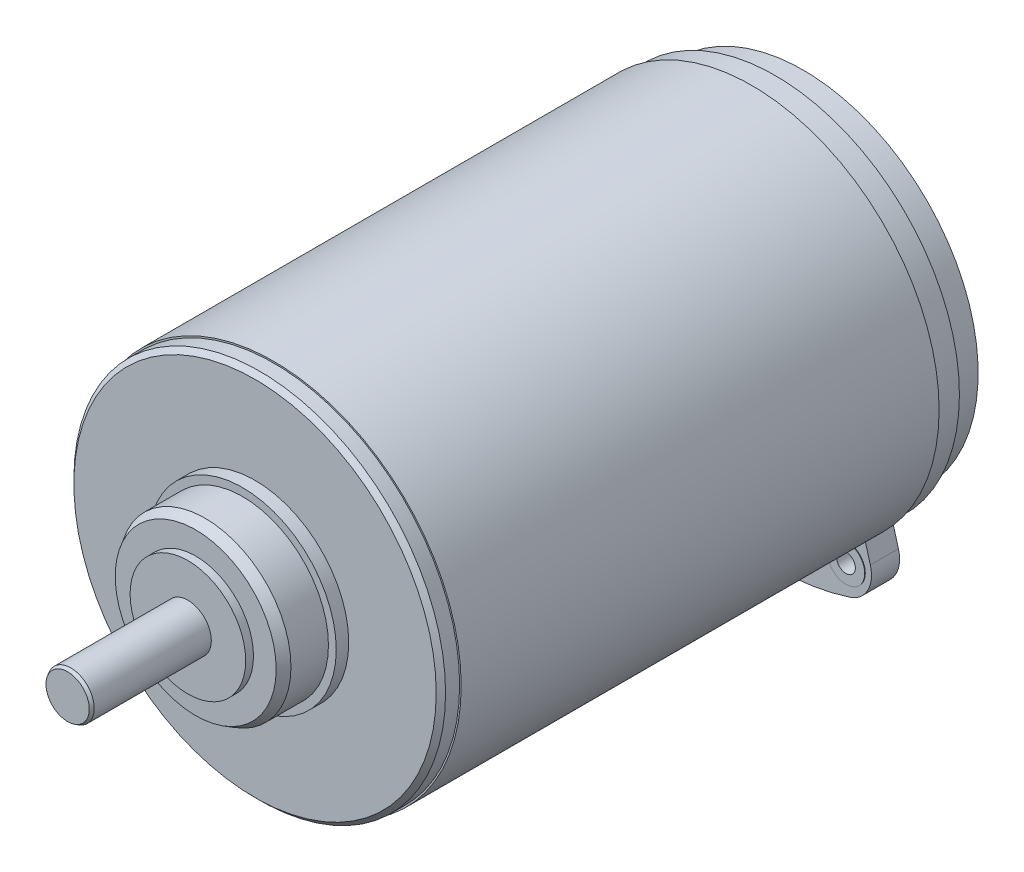
ISO-10303-21;
HEADER;
FILE_DESCRIPTION(('STEP AP214'),'2;1');
FILE_NAME('part.step','',(''),(''),'','','');
FILE_SCHEMA(('AUTOMOTIVE_DESIGN { 1 0 10303 214 1 1 1 1 }'));
ENDSEC;
DATA;
#1=APPLICATION_CONTEXT('core data for automotive mechanical design processes');
#2=APPLICATION_PROTOCOL_DEFINITION('international standard','automotive_design',2000,#1);
#3=PRODUCT_CONTEXT('',#1,'mechanical');
#4=PRODUCT('Part','Part','',(#3));
#5=PRODUCT_RELATED_PRODUCT_CATEGORY('part','',(#4));
#6=PRODUCT_DEFINITION_FORMATION('','',#4);
#7=PRODUCT_DEFINITION_CONTEXT('part definition',#1,'design');
#8=PRODUCT_DEFINITION('design','',#6,#7);
#9=PRODUCT_DEFINITION_SHAPE('','',#8);
#10=(LENGTH_UNIT() NAMED_UNIT(*) SI_UNIT(.MILLI.,.METRE.));
#11=(NAMED_UNIT(*) PLANE_ANGLE_UNIT() SI_UNIT($,.RADIAN.));
#12=(NAMED_UNIT(*) SI_UNIT($,.STERADIAN.) SOLID_ANGLE_UNIT());
#13=UNCERTAINTY_MEASURE_WITH_UNIT(LENGTH_MEASURE(1.E-05),#10,'distance_accuracy_value','');
#14=(GEOMETRIC_REPRESENTATION_CONTEXT(3) GLOBAL_UNCERTAINTY_ASSIGNED_CONTEXT((#13)) GLOBAL_UNIT_ASSIGNED_CONTEXT((#10,
#11,#12)) REPRESENTATION_CONTEXT('',''));
#15=CARTESIAN_POINT('',(0.,0.,0.));
#16=DIRECTION('',(0.,0.,1.));
#17=DIRECTION('',(1.,0.,0.));
#18=AXIS2_PLACEMENT_3D('',#15,#16,#17);
#19=CARTESIAN_POINT('',(-0.775442014310161,-6.80596721138463,-16.632));
#20=DIRECTION('',(0.,0.,-1.));
#21=DIRECTION('',(0.,-1.,0.));
#22=AXIS2_PLACEMENT_3D('',#19,#20,#21);
#23=PLANE('',#22);
#24=CARTESIAN_POINT('',(-0.775442014310161,-6.80596721138463,-16.632));
#25=DIRECTION('',(0.,0.,1.));
#26=DIRECTION('',(1.,0.,0.));
#27=AXIS2_PLACEMENT_3D('',#24,#25,#26);
#28=CIRCLE('',#27,0.6);
#29=CARTESIAN_POINT('',(-0.175442014310161,-6.80596721138463,-16.632));
#30=VERTEX_POINT('',#29);
#31=EDGE_CURVE('E11',#30,#30,#28,.T.);
#32=ORIENTED_EDGE('',*,*,#31,.T.);
#33=EDGE_LOOP('',(#32));
#34=FACE_BOUND('',#33,.T.);
#35=CARTESIAN_POINT('',(-0.775442014310161,-6.80596721138463,-16.632));
#36=DIRECTION('',(0.,0.,1.));
#37=DIRECTION('',(1.,0.,0.));
#38=AXIS2_PLACEMENT_3D('',#35,#36,#37);
#39=CIRCLE('',#38,0.3);
#40=CARTESIAN_POINT('',(-0.475442014310161,-6.80596721138463,-16.632));
#41=VERTEX_POINT('',#40);
#42=EDGE_CURVE('E324',#41,#41,#39,.T.);
#43=ORIENTED_EDGE('',*,*,#42,.F.);
#44=EDGE_LOOP('',(#43));
#45=FACE_BOUND('',#44,.T.);
#46=ADVANCED_FACE('F16',(#34,#45),#23,.F.);
#47=CARTESIAN_POINT('',(-0.775442014310161,-6.80596721138463,-17.568));
#48=DIRECTION('',(0.,0.,-1.));
#49=DIRECTION('',(0.,-1.,0.));
#50=AXIS2_PLACEMENT_3D('',#47,#48,#49);
#51=PLANE('',#50);
#52=CARTESIAN_POINT('',(-0.775442014310161,-6.80596721138463,-17.568));
#53=DIRECTION('',(0.,0.,1.));
#54=DIRECTION('',(1.,0.,0.));
#55=AXIS2_PLACEMENT_3D('',#52,#53,#54);
#56=CIRCLE('',#55,0.6);
#57=CARTESIAN_POINT('',(-0.175442014310161,-6.80596721138463,-17.568));
#58=VERTEX_POINT('',#57);
#59=EDGE_CURVE('E280',#58,#58,#56,.T.);
#60=ORIENTED_EDGE('',*,*,#59,.F.);
#61=EDGE_LOOP('',(#60));
#62=FACE_BOUND('',#61,.T.);
#63=CARTESIAN_POINT('',(-0.775442014310161,-6.80596721138463,-17.568));
#64=DIRECTION('',(0.,0.,1.));
#65=DIRECTION('',(1.,0.,0.));
#66=AXIS2_PLACEMENT_3D('',#63,#64,#65);
#67=CIRCLE('',#66,0.3);
#68=CARTESIAN_POINT('',(-0.475442014310161,-6.80596721138463,-17.568));
#69=VERTEX_POINT('',#68);
#70=EDGE_CURVE('E27',#69,#69,#67,.T.);
#71=ORIENTED_EDGE('',*,*,#70,.T.);
#72=EDGE_LOOP('',(#71));
#73=FACE_BOUND('',#72,.T.);
#74=ADVANCED_FACE('F18',(#62,#73),#51,.T.);
#75=CARTESIAN_POINT('',(-2.28657698575133,-6.45709421398143,-16.632));
#76=DIRECTION('',(0.,0.,-1.));
#77=DIRECTION('',(0.,-1.,0.));
#78=AXIS2_PLACEMENT_3D('',#75,#76,#77);
#79=PLANE('',#78);
#80=CARTESIAN_POINT('',(-2.28657698575133,-6.45709421398143,-16.632));
#81=DIRECTION('',(0.,0.,1.));
#82=DIRECTION('',(0.974370064785235,-0.224951054343866,0.));
#83=AXIS2_PLACEMENT_3D('',#80,#81,#82);
#84=CIRCLE('',#83,0.6);
#85=CARTESIAN_POINT('',(-1.70195494688019,-6.59206484658775,-16.632));
#86=VERTEX_POINT('',#85);
#87=EDGE_CURVE('E306',#86,#86,#84,.T.);
#88=ORIENTED_EDGE('',*,*,#87,.T.);
#89=EDGE_LOOP('',(#88));
#90=FACE_BOUND('',#89,.T.);
#91=CARTESIAN_POINT('',(-2.28657698575133,-6.45709421398143,-16.632));
#92=DIRECTION('',(0.,0.,1.));
#93=DIRECTION('',(0.974370064785235,-0.224951054343866,0.));
#94=AXIS2_PLACEMENT_3D('',#91,#92,#93);
#95=CIRCLE('',#94,0.3);
#96=CARTESIAN_POINT('',(-1.99426596631576,-6.52457953028459,-16.632));
#97=VERTEX_POINT('',#96);
#98=EDGE_CURVE('E319',#97,#97,#95,.T.);
#99=ORIENTED_EDGE('',*,*,#98,.F.);
#100=EDGE_LOOP('',(#99));
#101=FACE_BOUND('',#100,.T.);
#102=ADVANCED_FACE('F498',(#90,#101),#79,.F.);
#103=CARTESIAN_POINT('',(-2.28657698575133,-6.45709421398143,-17.568));
#104=DIRECTION('',(0.,0.,-1.));
#105=DIRECTION('',(0.,-1.,0.));
#106=AXIS2_PLACEMENT_3D('',#103,#104,#105);
#107=PLANE('',#106);
#108=CARTESIAN_POINT('',(-2.28657698575133,-6.45709421398143,-17.568));
#109=DIRECTION('',(0.,0.,1.));
#110=DIRECTION('',(0.974370064785235,-0.224951054343866,0.));
#111=AXIS2_PLACEMENT_3D('',#108,#109,#110);
#112=CIRCLE('',#111,0.6);
#113=CARTESIAN_POINT('',(-1.70195494688019,-6.59206484658775,-17.568));
#114=VERTEX_POINT('',#113);
#115=EDGE_CURVE('E275',#114,#114,#112,.T.);
#116=ORIENTED_EDGE('',*,*,#115,.F.);
#117=EDGE_LOOP('',(#116));
#118=FACE_BOUND('',#117,.T.);
#119=CARTESIAN_POINT('',(-2.28657698575133,-6.45709421398143,-17.568));
#120=DIRECTION('',(0.,0.,1.));
#121=DIRECTION('',(0.974370064785235,-0.224951054343866,0.));
#122=AXIS2_PLACEMENT_3D('',#119,#120,#121);
#123=CIRCLE('',#122,0.3);
#124=CARTESIAN_POINT('',(-1.99426596631576,-6.52457953028459,-17.568));
#125=VERTEX_POINT('',#124);
#126=EDGE_CURVE('E378',#125,#125,#123,.T.);
#127=ORIENTED_EDGE('',*,*,#126,.T.);
#128=EDGE_LOOP('',(#127));
#129=FACE_BOUND('',#128,.T.);
#130=ADVANCED_FACE('F604',(#118,#129),#107,.T.);
#131=CARTESIAN_POINT('',(0.,0.,-17.55));
#132=DIRECTION('',(0.,0.,-1.));
#133=DIRECTION('',(0.,-1.,0.));
#134=AXIS2_PLACEMENT_3D('',#131,#132,#133);
#135=PLANE('',#134);
#136=CARTESIAN_POINT('',(-2.28657698575133,-6.45709421398143,-17.55));
#137=DIRECTION('',(0.,0.,1.));
#138=DIRECTION('',(-1.,0.,0.));
#139=AXIS2_PLACEMENT_3D('',#136,#137,#138);
#140=CIRCLE('',#139,0.6);
#141=CARTESIAN_POINT('',(-2.88657698575133,-6.45709421398143,-17.55));
#142=VERTEX_POINT('',#141);
#143=EDGE_CURVE('E400',#142,#142,#140,.T.);
#144=ORIENTED_EDGE('',*,*,#143,.T.);
#145=EDGE_LOOP('',(#144));
#146=FACE_BOUND('',#145,.T.);
#147=CARTESIAN_POINT('',(2.28657698575133,-6.45709421398143,-17.55));
#148=DIRECTION('',(0.,0.,1.));
#149=DIRECTION('',(-1.,0.,0.));
#150=AXIS2_PLACEMENT_3D('',#147,#148,#149);
#151=CIRCLE('',#150,0.6);
#152=CARTESIAN_POINT('',(1.68657698575133,-6.45709421398143,-17.55));
#153=VERTEX_POINT('',#152);
#154=EDGE_CURVE('E404',#153,#153,#151,.T.);
#155=ORIENTED_EDGE('',*,*,#154,.T.);
#156=EDGE_LOOP('',(#155));
#157=FACE_BOUND('',#156,.T.);
#158=CARTESIAN_POINT('',(0.,0.,-17.55));
#159=DIRECTION('',(0.,0.,-1.));
#160=DIRECTION('',(-1.,0.,0.));
#161=AXIS2_PLACEMENT_3D('',#158,#159,#160);
#162=CIRCLE('',#161,5.6);
#163=CARTESIAN_POINT('',(-2.69825791088499,-4.90707695541313,-17.55));
#164=VERTEX_POINT('',#163);
#165=CARTESIAN_POINT('',(2.69825791088499,-4.90707695541313,-17.55));
#166=VERTEX_POINT('',#165);
#167=EDGE_CURVE('E448',#164,#166,#162,.T.);
#168=ORIENTED_EDGE('',*,*,#167,.T.);
#169=DIRECTION('',(-0.270785264534964,0.962639777128875,0.));
#170=VECTOR('',#169,1.);
#171=CARTESIAN_POINT('',(3.04763977712888,-6.14912711804472,-17.55));
#172=LINE('',#171,#170);
#173=CARTESIAN_POINT('',(3.04763977712888,-6.14912711804473,-17.55));
#174=VERTEX_POINT('',#173);
#175=EDGE_CURVE('E289',#174,#166,#172,.T.);
#176=ORIENTED_EDGE('',*,*,#175,.F.);
#177=CARTESIAN_POINT('',(2.085,-6.41991238257969,-17.55));
#178=DIRECTION('',(0.,0.,1.));
#179=DIRECTION('',(1.,0.,0.));
#180=AXIS2_PLACEMENT_3D('',#177,#178,#179);
#181=CIRCLE('',#180,1.);
#182=CARTESIAN_POINT('',(2.39388888888889,-7.37101051333223,-17.55));
#183=VERTEX_POINT('',#182);
#184=EDGE_CURVE('E465',#183,#174,#181,.T.);
#185=ORIENTED_EDGE('',*,*,#184,.F.);
#186=CARTESIAN_POINT('',(0.,0.,-17.55));
#187=DIRECTION('',(0.,0.,1.));
#188=DIRECTION('',(-1.,0.,0.));
#189=AXIS2_PLACEMENT_3D('',#186,#187,#188);
#190=CIRCLE('',#189,7.75);
#191=CARTESIAN_POINT('',(-2.39388888888889,-7.37101051333223,-17.55));
#192=VERTEX_POINT('',#191);
#193=EDGE_CURVE('E456',#192,#183,#190,.T.);
#194=ORIENTED_EDGE('',*,*,#193,.F.);
#195=CARTESIAN_POINT('',(-2.085,-6.41991238257969,-17.55));
#196=DIRECTION('',(0.,0.,1.));
#197=DIRECTION('',(1.,0.,0.));
#198=AXIS2_PLACEMENT_3D('',#195,#196,#197);
#199=CIRCLE('',#198,1.);
#200=CARTESIAN_POINT('',(-3.04763977712888,-6.14912711804473,-17.55));
#201=VERTEX_POINT('',#200);
#202=EDGE_CURVE('E273',#201,#192,#199,.T.);
#203=ORIENTED_EDGE('',*,*,#202,.F.);
#204=DIRECTION('',(-0.270785264534963,-0.962639777128875,0.));
#205=VECTOR('',#204,1.);
#206=CARTESIAN_POINT('',(-2.55888032509132,-4.41159058411596,-17.55));
#207=LINE('',#206,#205);
#208=EDGE_CURVE('E334',#164,#201,#207,.T.);
#209=ORIENTED_EDGE('',*,*,#208,.F.);
#210=EDGE_LOOP('',(#168,#176,#185,#194,#203,#209));
#211=FACE_BOUND('',#210,.T.);
#212=CARTESIAN_POINT('',(0.,0.,-17.55));
#213=DIRECTION('',(0.,0.,1.));
#214=DIRECTION('',(1.,0.,0.));
#215=AXIS2_PLACEMENT_3D('',#212,#213,#214);
#216=CIRCLE('',#215,2.);
#217=CARTESIAN_POINT('',(2.,0.,-17.55));
#218=VERTEX_POINT('',#217);
#219=EDGE_CURVE('E452',#218,#218,#216,.T.);
#220=ORIENTED_EDGE('',*,*,#219,.T.);
#221=EDGE_LOOP('',(#220));
#222=FACE_BOUND('',#221,.T.);
#223=CARTESIAN_POINT('',(0.775442014310161,-6.80596721138463,-17.55));
#224=DIRECTION('',(0.,0.,1.));
#225=DIRECTION('',(-1.,0.,0.));
#226=AXIS2_PLACEMENT_3D('',#223,#224,#225);
#227=CIRCLE('',#226,0.6);
#228=CARTESIAN_POINT('',(0.175442014310161,-6.80596721138463,-17.55));
#229=VERTEX_POINT('',#228);
#230=EDGE_CURVE('E470',#229,#229,#227,.T.);
#231=ORIENTED_EDGE('',*,*,#230,.T.);
#232=EDGE_LOOP('',(#231));
#233=FACE_BOUND('',#232,.T.);
#234=CARTESIAN_POINT('',(-0.775442014310161,-6.80596721138463,-17.55));
#235=DIRECTION('',(0.,0.,1.));
#236=DIRECTION('',(-1.,0.,0.));
#237=AXIS2_PLACEMENT_3D('',#234,#235,#236);
#238=CIRCLE('',#237,0.6);
#239=CARTESIAN_POINT('',(-1.37544201431016,-6.80596721138463,-17.55));
#240=VERTEX_POINT('',#239);
#241=EDGE_CURVE('E460',#240,#240,#238,.T.);
#242=ORIENTED_EDGE('',*,*,#241,.T.);
#243=EDGE_LOOP('',(#242));
#244=FACE_BOUND('',#243,.T.);
#245=ADVANCED_FACE('F487',(#146,#157,#211,#222,#233,#244),#135,.T.);
#246=CARTESIAN_POINT('',(0.,0.,-16.65));
#247=DIRECTION('',(0.,0.,1.));
#248=DIRECTION('',(1.,0.,0.));
#249=AXIS2_PLACEMENT_3D('',#246,#247,#248);
#250=PLANE('',#249);
#251=CARTESIAN_POINT('',(-2.28657698575133,-6.45709421398143,-16.65));
#252=DIRECTION('',(0.,0.,-1.));
#253=DIRECTION('',(1.,0.,0.));
#254=AXIS2_PLACEMENT_3D('',#251,#252,#253);
#255=CIRCLE('',#254,0.6);
#256=CARTESIAN_POINT('',(-1.68657698575133,-6.45709421398143,-16.65));
#257=VERTEX_POINT('',#256);
#258=EDGE_CURVE('E332',#257,#257,#255,.T.);
#259=ORIENTED_EDGE('',*,*,#258,.T.);
#260=EDGE_LOOP('',(#259));
#261=FACE_BOUND('',#260,.T.);
#262=CARTESIAN_POINT('',(2.28657698575133,-6.45709421398143,-16.65));
#263=DIRECTION('',(0.,0.,-1.));
#264=DIRECTION('',(1.,0.,0.));
#265=AXIS2_PLACEMENT_3D('',#262,#263,#264);
#266=CIRCLE('',#265,0.6);
#267=CARTESIAN_POINT('',(2.88657698575133,-6.45709421398143,-16.65));
#268=VERTEX_POINT('',#267);
#269=EDGE_CURVE('E328',#268,#268,#266,.T.);
#270=ORIENTED_EDGE('',*,*,#269,.T.);
#271=EDGE_LOOP('',(#270));
#272=FACE_BOUND('',#271,.T.);
#273=DIRECTION('',(-0.270785264534964,0.962639777128875,0.));
#274=VECTOR('',#273,1.);
#275=CARTESIAN_POINT('',(3.04763977712888,-6.14912711804472,-16.65));
#276=LINE('',#275,#274);
#277=CARTESIAN_POINT('',(3.04763977712888,-6.14912711804473,-16.65));
#278=VERTEX_POINT('',#277);
#279=CARTESIAN_POINT('',(2.78154764818056,-5.20317140606585,-16.65));
#280=VERTEX_POINT('',#279);
#281=EDGE_CURVE('E333',#278,#280,#276,.T.);
#282=ORIENTED_EDGE('',*,*,#281,.T.);
#283=CARTESIAN_POINT('',(0.,0.,-16.65));
#284=DIRECTION('',(0.,0.,-1.));
#285=DIRECTION('',(-1.,0.,0.));
#286=AXIS2_PLACEMENT_3D('',#283,#284,#285);
#287=CIRCLE('',#286,5.9);
#288=CARTESIAN_POINT('',(-2.78154764818056,-5.20317140606585,-16.65));
#289=VERTEX_POINT('',#288);
#290=EDGE_CURVE('E342',#280,#289,#287,.T.);
#291=ORIENTED_EDGE('',*,*,#290,.T.);
#292=DIRECTION('',(-0.270785264534963,-0.962639777128875,0.));
#293=VECTOR('',#292,1.);
#294=CARTESIAN_POINT('',(-2.55888032509132,-4.41159058411596,-16.65));
#295=LINE('',#294,#293);
#296=CARTESIAN_POINT('',(-3.04763977712888,-6.14912711804473,-16.65));
#297=VERTEX_POINT('',#296);
#298=EDGE_CURVE('E417',#289,#297,#295,.T.);
#299=ORIENTED_EDGE('',*,*,#298,.T.);
#300=CARTESIAN_POINT('',(-2.085,-6.41991238257969,-16.65));
#301=DIRECTION('',(0.,0.,1.));
#302=DIRECTION('',(1.,0.,0.));
#303=AXIS2_PLACEMENT_3D('',#300,#301,#302);
#304=CIRCLE('',#303,1.);
#305=CARTESIAN_POINT('',(-2.39388888888889,-7.37101051333223,-16.65));
#306=VERTEX_POINT('',#305);
#307=EDGE_CURVE('E466',#297,#306,#304,.T.);
#308=ORIENTED_EDGE('',*,*,#307,.T.);
#309=CARTESIAN_POINT('',(0.,0.,-16.65));
#310=DIRECTION('',(0.,0.,1.));
#311=DIRECTION('',(-1.,0.,0.));
#312=AXIS2_PLACEMENT_3D('',#309,#310,#311);
#313=CIRCLE('',#312,7.75);
#314=CARTESIAN_POINT('',(2.39388888888889,-7.37101051333223,-16.65));
#315=VERTEX_POINT('',#314);
#316=EDGE_CURVE('E389',#306,#315,#313,.T.);
#317=ORIENTED_EDGE('',*,*,#316,.T.);
#318=CARTESIAN_POINT('',(2.085,-6.41991238257969,-16.65));
#319=DIRECTION('',(0.,0.,1.));
#320=DIRECTION('',(1.,0.,0.));
#321=AXIS2_PLACEMENT_3D('',#318,#319,#320);
#322=CIRCLE('',#321,1.);
#323=EDGE_CURVE('E301',#315,#278,#322,.T.);
#324=ORIENTED_EDGE('',*,*,#323,.T.);
#325=EDGE_LOOP('',(#282,#291,#299,#308,#317,#324));
#326=FACE_BOUND('',#325,.T.);
#327=CARTESIAN_POINT('',(0.775442014310161,-6.80596721138463,-16.65));
#328=DIRECTION('',(0.,0.,-1.));
#329=DIRECTION('',(1.,0.,0.));
#330=AXIS2_PLACEMENT_3D('',#327,#328,#329);
#331=CIRCLE('',#330,0.6);
#332=CARTESIAN_POINT('',(1.37544201431016,-6.80596721138463,-16.65));
#333=VERTEX_POINT('',#332);
#334=EDGE_CURVE('E297',#333,#333,#331,.T.);
#335=ORIENTED_EDGE('',*,*,#334,.T.);
#336=EDGE_LOOP('',(#335));
#337=FACE_BOUND('',#336,.T.);
#338=CARTESIAN_POINT('',(-0.775442014310161,-6.80596721138463,-16.65));
#339=DIRECTION('',(0.,0.,-1.));
#340=DIRECTION('',(1.,0.,0.));
#341=AXIS2_PLACEMENT_3D('',#338,#339,#340);
#342=CIRCLE('',#341,0.6);
#343=CARTESIAN_POINT('',(-0.175442014310161,-6.80596721138463,-16.65));
#344=VERTEX_POINT('',#343);
#345=EDGE_CURVE('E302',#344,#344,#342,.T.);
#346=ORIENTED_EDGE('',*,*,#345,.T.);
#347=EDGE_LOOP('',(#346));
#348=FACE_BOUND('',#347,.T.);
#349=ADVANCED_FACE('F954',(#261,#272,#326,#337,#348),#250,.T.);
#350=CARTESIAN_POINT('',(0.,0.,-16.65));
#351=DIRECTION('',(0.,0.,-1.));
#352=DIRECTION('',(0.,-1.,0.));
#353=AXIS2_PLACEMENT_3D('',#350,#351,#352);
#354=PLANE('',#353);
#355=CARTESIAN_POINT('',(0.,0.,-16.65));
#356=DIRECTION('',(0.,0.,-1.));
#357=DIRECTION('',(-1.,0.,0.));
#358=AXIS2_PLACEMENT_3D('',#355,#356,#357);
#359=CIRCLE('',#358,5.9);
#360=EDGE_CURVE('E371',#289,#280,#359,.T.);
#361=ORIENTED_EDGE('',*,*,#360,.T.);
#362=DIRECTION('',(-0.270785264534964,0.962639777128875,0.));
#363=VECTOR('',#362,1.);
#364=CARTESIAN_POINT('',(3.04763977712888,-6.14912711804472,-16.65));
#365=LINE('',#364,#363);
#366=CARTESIAN_POINT('',(2.69825791088499,-4.90707695541313,-16.65));
#367=VERTEX_POINT('',#366);
#368=EDGE_CURVE('E373',#280,#367,#365,.T.);
#369=ORIENTED_EDGE('',*,*,#368,.T.);
#370=CARTESIAN_POINT('',(0.,0.,-16.65));
#371=DIRECTION('',(0.,0.,-1.));
#372=DIRECTION('',(-1.,0.,0.));
#373=AXIS2_PLACEMENT_3D('',#370,#371,#372);
#374=CIRCLE('',#373,5.6);
#375=CARTESIAN_POINT('',(-2.69825791088499,-4.90707695541313,-16.65));
#376=VERTEX_POINT('',#375);
#377=EDGE_CURVE('E295',#376,#367,#374,.T.);
#378=ORIENTED_EDGE('',*,*,#377,.F.);
#379=DIRECTION('',(-0.270785264534963,-0.962639777128875,0.));
#380=VECTOR('',#379,1.);
#381=CARTESIAN_POINT('',(-2.55888032509132,-4.41159058411596,-16.65));
#382=LINE('',#381,#380);
#383=EDGE_CURVE('E262',#376,#289,#382,.T.);
#384=ORIENTED_EDGE('',*,*,#383,.T.);
#385=EDGE_LOOP('',(#361,#369,#378,#384));
#386=FACE_BOUND('',#385,.T.);
#387=ADVANCED_FACE('F596',(#386),#354,.T.);
#388=CARTESIAN_POINT('',(0.,0.,-17.45));
#389=DIRECTION('',(0.,0.,1.));
#390=DIRECTION('',(1.,0.,0.));
#391=AXIS2_PLACEMENT_3D('',#388,#389,#390);
#392=PLANE('',#391);
#393=CARTESIAN_POINT('',(0.,0.,-17.45));
#394=DIRECTION('',(0.,0.,1.));
#395=DIRECTION('',(1.,0.,0.));
#396=AXIS2_PLACEMENT_3D('',#393,#394,#395);
#397=CIRCLE('',#396,2.);
#398=CARTESIAN_POINT('',(2.,0.,-17.45));
#399=VERTEX_POINT('',#398);
#400=EDGE_CURVE('E291',#399,#399,#397,.T.);
#401=ORIENTED_EDGE('',*,*,#400,.F.);
#402=EDGE_LOOP('',(#401));
#403=FACE_BOUND('',#402,.T.);
#404=CARTESIAN_POINT('',(0.,0.,-17.45));
#405=DIRECTION('',(0.,0.,-1.));
#406=DIRECTION('',(1.,0.,0.));
#407=AXIS2_PLACEMENT_3D('',#404,#405,#406);
#408=CIRCLE('',#407,0.75);
#409=CARTESIAN_POINT('',(0.75,0.,-17.45));
#410=VERTEX_POINT('',#409);
#411=EDGE_CURVE('E443',#410,#410,#408,.T.);
#412=ORIENTED_EDGE('',*,*,#411,.F.);
#413=EDGE_LOOP('',(#412));
#414=FACE_BOUND('',#413,.T.);
#415=ADVANCED_FACE('F587',(#403,#414),#392,.F.);
#416=CARTESIAN_POINT('',(0.,0.,0.));
#417=DIRECTION('',(0.,0.,1.));
#418=DIRECTION('',(1.,0.,0.));
#419=AXIS2_PLACEMENT_3D('',#416,#417,#418);
#420=PLANE('',#419);
#421=CARTESIAN_POINT('',(0.,0.,0.));
#422=DIRECTION('',(0.,0.,1.));
#423=DIRECTION('',(1.,0.,0.));
#424=AXIS2_PLACEMENT_3D('',#421,#422,#423);
#425=CIRCLE('',#424,5.8);
#426=CARTESIAN_POINT('',(5.8,0.,0.));
#427=VERTEX_POINT('',#426);
#428=EDGE_CURVE('E253',#427,#427,#425,.T.);
#429=ORIENTED_EDGE('',*,*,#428,.T.);
#430=EDGE_LOOP('',(#429));
#431=FACE_BOUND('',#430,.T.);
#432=CARTESIAN_POINT('',(0.,0.,0.));
#433=DIRECTION('',(0.,0.,1.));
#434=DIRECTION('',(1.,0.,0.));
#435=AXIS2_PLACEMENT_3D('',#432,#433,#434);
#436=CIRCLE('',#435,3.);
#437=CARTESIAN_POINT('',(3.,0.,0.));
#438=VERTEX_POINT('',#437);
#439=EDGE_CURVE('E254',#438,#438,#436,.T.);
#440=ORIENTED_EDGE('',*,*,#439,.F.);
#441=EDGE_LOOP('',(#440));
#442=FACE_BOUND('',#441,.T.);
#443=ADVANCED_FACE('F584',(#431,#442),#420,.T.);
#444=CARTESIAN_POINT('',(0.,0.,0.4));
#445=DIRECTION('',(0.,0.,1.));
#446=DIRECTION('',(1.,0.,0.));
#447=AXIS2_PLACEMENT_3D('',#444,#445,#446);
#448=PLANE('',#447);
#449=CARTESIAN_POINT('',(0.,0.,0.4));
#450=DIRECTION('',(0.,0.,1.));
#451=DIRECTION('',(1.,0.,0.));
#452=AXIS2_PLACEMENT_3D('',#449,#450,#451);
#453=CIRCLE('',#452,2.75);
#454=CARTESIAN_POINT('',(2.75,0.,0.4));
#455=VERTEX_POINT('',#454);
#456=EDGE_CURVE('E409',#455,#455,#453,.T.);
#457=ORIENTED_EDGE('',*,*,#456,.F.);
#458=EDGE_LOOP('',(#457));
#459=FACE_BOUND('',#458,.T.);
#460=CARTESIAN_POINT('',(0.,0.,0.4));
#461=DIRECTION('',(0.,0.,1.));
#462=DIRECTION('',(1.,0.,0.));
#463=AXIS2_PLACEMENT_3D('',#460,#461,#462);
#464=CIRCLE('',#463,3.);
#465=CARTESIAN_POINT('',(3.,0.,0.4));
#466=VERTEX_POINT('',#465);
#467=EDGE_CURVE('E248',#466,#466,#464,.T.);
#468=ORIENTED_EDGE('',*,*,#467,.T.);
#469=EDGE_LOOP('',(#468));
#470=FACE_BOUND('',#469,.T.);
#471=ADVANCED_FACE('F543',(#459,#470),#448,.T.);
#472=CARTESIAN_POINT('',(0.,0.,0.));
#473=DIRECTION('',(0.,0.,1.));
#474=DIRECTION('',(1.,0.,0.));
#475=AXIS2_PLACEMENT_3D('',#472,#473,#474);
#476=CYLINDRICAL_SURFACE('',#475,3.);
#477=ORIENTED_EDGE('',*,*,#467,.F.);
#478=EDGE_LOOP('',(#477));
#479=FACE_BOUND('',#478,.T.);
#480=ORIENTED_EDGE('',*,*,#439,.T.);
#481=EDGE_LOOP('',(#480));
#482=FACE_BOUND('',#481,.T.);
#483=ADVANCED_FACE('F249',(#479,#482),#476,.T.);
#484=CARTESIAN_POINT('',(0.,0.,1.9));
#485=DIRECTION('',(0.,0.,1.));
#486=DIRECTION('',(1.,0.,0.));
#487=AXIS2_PLACEMENT_3D('',#484,#485,#486);
#488=PLANE('',#487);
#489=CARTESIAN_POINT('',(0.,0.,1.9));
#490=DIRECTION('',(0.,0.,1.));
#491=DIRECTION('',(1.,0.,0.));
#492=AXIS2_PLACEMENT_3D('',#489,#490,#491);
#493=CIRCLE('',#492,1.85);
#494=CARTESIAN_POINT('',(1.85,0.,1.9));
#495=VERTEX_POINT('',#494);
#496=EDGE_CURVE('E405',#495,#495,#493,.T.);
#497=ORIENTED_EDGE('',*,*,#496,.F.);
#498=EDGE_LOOP('',(#497));
#499=FACE_BOUND('',#498,.T.);
#500=CARTESIAN_POINT('',(0.,0.,1.9));
#501=DIRECTION('',(0.,0.,1.));
#502=DIRECTION('',(1.,0.,0.));
#503=AXIS2_PLACEMENT_3D('',#500,#501,#502);
#504=CIRCLE('',#503,2.57679491924312);
#505=CARTESIAN_POINT('',(2.57679491924312,0.,1.9));
#506=VERTEX_POINT('',#505);
#507=EDGE_CURVE('E265',#506,#506,#504,.T.);
#508=ORIENTED_EDGE('',*,*,#507,.T.);
#509=EDGE_LOOP('',(#508));
#510=FACE_BOUND('',#509,.T.);
#511=ADVANCED_FACE('F542',(#499,#510),#488,.T.);
#512=CARTESIAN_POINT('',(0.,0.,0.4));
#513=DIRECTION('',(0.,0.,1.));
#514=DIRECTION('',(1.,0.,0.));
#515=AXIS2_PLACEMENT_3D('',#512,#513,#514);
#516=CYLINDRICAL_SURFACE('',#515,2.75);
#517=CARTESIAN_POINT('',(0.,0.,1.6));
#518=DIRECTION('',(0.,0.,-1.));
#519=DIRECTION('',(1.,0.,0.));
#520=AXIS2_PLACEMENT_3D('',#517,#518,#519);
#521=CIRCLE('',#520,2.75);
#522=CARTESIAN_POINT('',(2.75,0.,1.6));
#523=VERTEX_POINT('',#522);
#524=EDGE_CURVE('E393',#523,#523,#521,.T.);
#525=ORIENTED_EDGE('',*,*,#524,.T.);
#526=EDGE_LOOP('',(#525));
#527=FACE_BOUND('',#526,.T.);
#528=ORIENTED_EDGE('',*,*,#456,.T.);
#529=EDGE_LOOP('',(#528));
#530=FACE_BOUND('',#529,.T.);
#531=ADVANCED_FACE('F622',(#527,#530),#516,.T.);
#532=CARTESIAN_POINT('',(0.,0.,1.9));
#533=DIRECTION('',(0.,0.,-1.));
#534=DIRECTION('',(-1.,0.,0.));
#535=AXIS2_PLACEMENT_3D('',#532,#533,#534);
#536=CONICAL_SURFACE('',#535,2.57679491924312,0.523598775);
#537=ORIENTED_EDGE('',*,*,#524,.F.);
#538=EDGE_LOOP('',(#537));
#539=FACE_BOUND('',#538,.T.);
#540=ORIENTED_EDGE('',*,*,#507,.F.);
#541=EDGE_LOOP('',(#540));
#542=FACE_BOUND('',#541,.T.);
#543=ADVANCED_FACE('F528',(#539,#542),#536,.T.);
#544=CARTESIAN_POINT('',(0.,0.,2.15));
#545=DIRECTION('',(0.,0.,1.));
#546=DIRECTION('',(1.,0.,0.));
#547=AXIS2_PLACEMENT_3D('',#544,#545,#546);
#548=PLANE('',#547);
#549=CARTESIAN_POINT('',(0.,0.,2.15));
#550=DIRECTION('',(0.,0.,1.));
#551=DIRECTION('',(1.,0.,0.));
#552=AXIS2_PLACEMENT_3D('',#549,#550,#551);
#553=CIRCLE('',#552,0.75);
#554=CARTESIAN_POINT('',(0.75,0.,2.15));
#555=VERTEX_POINT('',#554);
#556=EDGE_CURVE('E347',#555,#555,#553,.T.);
#557=ORIENTED_EDGE('',*,*,#556,.F.);
#558=EDGE_LOOP('',(#557));
#559=FACE_BOUND('',#558,.T.);
#560=CARTESIAN_POINT('',(0.,0.,2.15));
#561=DIRECTION('',(0.,0.,-1.));
#562=DIRECTION('',(-1.,0.,0.));
#563=AXIS2_PLACEMENT_3D('',#560,#561,#562);
#564=CIRCLE('',#563,1.85);
#565=CARTESIAN_POINT('',(-1.85,0.,2.15));
#566=VERTEX_POINT('',#565);
#567=EDGE_CURVE('E410',#566,#566,#564,.T.);
#568=ORIENTED_EDGE('',*,*,#567,.F.);
#569=EDGE_LOOP('',(#568));
#570=FACE_BOUND('',#569,.T.);
#571=ADVANCED_FACE('F524',(#559,#570),#548,.T.);
#572=CARTESIAN_POINT('',(0.,0.,0.));
#573=DIRECTION('',(0.,0.,1.));
#574=DIRECTION('',(1.,0.,0.));
#575=AXIS2_PLACEMENT_3D('',#572,#573,#574);
#576=CYLINDRICAL_SURFACE('',#575,1.85);
#577=ORIENTED_EDGE('',*,*,#496,.T.);
#578=EDGE_LOOP('',(#577));
#579=FACE_BOUND('',#578,.T.);
#580=ORIENTED_EDGE('',*,*,#567,.T.);
#581=EDGE_LOOP('',(#580));
#582=FACE_BOUND('',#581,.T.);
#583=ADVANCED_FACE('F527',(#579,#582),#576,.T.);
#584=CARTESIAN_POINT('',(0.,0.,-0.3));
#585=DIRECTION('',(0.,0.,-1.));
#586=DIRECTION('',(-1.,0.,0.));
#587=AXIS2_PLACEMENT_3D('',#584,#585,#586);
#588=CYLINDRICAL_SURFACE('',#587,5.95);
#589=CARTESIAN_POINT('',(0.,0.,-0.15));
#590=DIRECTION('',(0.,0.,-1.));
#591=DIRECTION('',(1.,0.,0.));
#592=AXIS2_PLACEMENT_3D('',#589,#590,#591);
#593=CIRCLE('',#592,5.95);
#594=CARTESIAN_POINT('',(5.95,0.,-0.15));
#595=VERTEX_POINT('',#594);
#596=EDGE_CURVE('E425',#595,#595,#593,.T.);
#597=ORIENTED_EDGE('',*,*,#596,.T.);
#598=EDGE_LOOP('',(#597));
#599=FACE_BOUND('',#598,.T.);
#600=CARTESIAN_POINT('',(0.,0.,-0.6));
#601=DIRECTION('',(0.,0.,-1.));
#602=DIRECTION('',(-1.,0.,0.));
#603=AXIS2_PLACEMENT_3D('',#600,#601,#602);
#604=CIRCLE('',#603,5.95);
#605=CARTESIAN_POINT('',(-5.95,0.,-0.6));
#606=VERTEX_POINT('',#605);
#607=EDGE_CURVE('E346',#606,#606,#604,.T.);
#608=ORIENTED_EDGE('',*,*,#607,.F.);
#609=EDGE_LOOP('',(#608));
#610=FACE_BOUND('',#609,.T.);
#611=ADVANCED_FACE('F532',(#599,#610),#588,.T.);
#612=CARTESIAN_POINT('',(0.,0.,-0.6));
#613=DIRECTION('',(0.,0.,-1.));
#614=DIRECTION('',(0.,-1.,0.));
#615=AXIS2_PLACEMENT_3D('',#612,#613,#614);
#616=PLANE('',#615);
#617=CARTESIAN_POINT('',(0.,0.,-0.6));
#618=DIRECTION('',(0.,0.,1.));
#619=DIRECTION('',(-1.,0.,0.));
#620=AXIS2_PLACEMENT_3D('',#617,#618,#619);
#621=CIRCLE('',#620,6.);
#622=CARTESIAN_POINT('',(-6.,0.,-0.6));
#623=VERTEX_POINT('',#622);
#624=EDGE_CURVE('E421',#623,#623,#621,.T.);
#625=ORIENTED_EDGE('',*,*,#624,.T.);
#626=EDGE_LOOP('',(#625));
#627=FACE_BOUND('',#626,.T.);
#628=ORIENTED_EDGE('',*,*,#607,.T.);
#629=EDGE_LOOP('',(#628));
#630=FACE_BOUND('',#629,.T.);
#631=ADVANCED_FACE('F574',(#627,#630),#616,.F.);
#632=CARTESIAN_POINT('',(0.,0.,0.));
#633=DIRECTION('',(0.,0.,-1.));
#634=DIRECTION('',(-1.,0.,0.));
#635=AXIS2_PLACEMENT_3D('',#632,#633,#634);
#636=CYLINDRICAL_SURFACE('',#635,6.);
#637=CARTESIAN_POINT('',(0.,0.,-15.9));
#638=DIRECTION('',(0.,0.,-1.));
#639=DIRECTION('',(-1.,0.,0.));
#640=AXIS2_PLACEMENT_3D('',#637,#638,#639);
#641=CIRCLE('',#640,6.);
#642=CARTESIAN_POINT('',(-6.,0.,-15.9));
#643=VERTEX_POINT('',#642);
#644=EDGE_CURVE('E359',#643,#643,#641,.T.);
#645=ORIENTED_EDGE('',*,*,#644,.F.);
#646=EDGE_LOOP('',(#645));
#647=FACE_BOUND('',#646,.T.);
#648=ORIENTED_EDGE('',*,*,#624,.F.);
#649=EDGE_LOOP('',(#648));
#650=FACE_BOUND('',#649,.T.);
#651=ADVANCED_FACE('F577',(#647,#650),#636,.T.);
#652=CARTESIAN_POINT('',(0.,0.,-0.15));
#653=DIRECTION('',(0.,0.,-1.));
#654=DIRECTION('',(-1.,0.,0.));
#655=AXIS2_PLACEMENT_3D('',#652,#653,#654);
#656=CONICAL_SURFACE('',#655,5.95,0.7853981625);
#657=ORIENTED_EDGE('',*,*,#428,.F.);
#658=EDGE_LOOP('',(#657));
#659=FACE_BOUND('',#658,.T.);
#660=ORIENTED_EDGE('',*,*,#596,.F.);
#661=EDGE_LOOP('',(#660));
#662=FACE_BOUND('',#661,.T.);
#663=ADVANCED_FACE('F600',(#659,#662),#656,.T.);
#664=CARTESIAN_POINT('',(0.,0.,6.));
#665=DIRECTION('',(0.,0.,-1.));
#666=DIRECTION('',(-1.,0.,0.));
#667=AXIS2_PLACEMENT_3D('',#664,#665,#666);
#668=CYLINDRICAL_SURFACE('',#667,0.75);
#669=CARTESIAN_POINT('',(0.,0.,5.9));
#670=DIRECTION('',(0.,0.,-1.));
#671=DIRECTION('',(-1.,0.,0.));
#672=AXIS2_PLACEMENT_3D('',#669,#670,#671);
#673=CIRCLE('',#672,0.75);
#674=CARTESIAN_POINT('',(-0.75,0.,5.9));
#675=VERTEX_POINT('',#674);
#676=EDGE_CURVE('E343',#675,#675,#673,.T.);
#677=ORIENTED_EDGE('',*,*,#676,.T.);
#678=EDGE_LOOP('',(#677));
#679=FACE_BOUND('',#678,.T.);
#680=ORIENTED_EDGE('',*,*,#556,.T.);
#681=EDGE_LOOP('',(#680));
#682=FACE_BOUND('',#681,.T.);
#683=ADVANCED_FACE('F582',(#679,#682),#668,.T.);
#684=CARTESIAN_POINT('',(0.,0.,6.));
#685=DIRECTION('',(0.,0.,-1.));
#686=DIRECTION('',(0.,-1.,0.));
#687=AXIS2_PLACEMENT_3D('',#684,#685,#686);
#688=PLANE('',#687);
#689=CARTESIAN_POINT('',(0.,0.,6.));
#690=DIRECTION('',(0.,0.,1.));
#691=DIRECTION('',(-1.,0.,0.));
#692=AXIS2_PLACEMENT_3D('',#689,#690,#691);
#693=CIRCLE('',#692,0.692264973081038);
#694=CARTESIAN_POINT('',(-0.692264973081038,0.,6.));
#695=VERTEX_POINT('',#694);
#696=EDGE_CURVE('E366',#695,#695,#693,.T.);
#697=ORIENTED_EDGE('',*,*,#696,.T.);
#698=EDGE_LOOP('',(#697));
#699=FACE_BOUND('',#698,.T.);
#700=ADVANCED_FACE('F579',(#699),#688,.F.);
#701=CARTESIAN_POINT('',(0.,0.,5.9));
#702=DIRECTION('',(0.,0.,-1.));
#703=DIRECTION('',(-1.,0.,0.));
#704=AXIS2_PLACEMENT_3D('',#701,#702,#703);
#705=CONICAL_SURFACE('',#704,0.75,0.523598775);
#706=ORIENTED_EDGE('',*,*,#696,.F.);
#707=EDGE_LOOP('',(#706));
#708=FACE_BOUND('',#707,.T.);
#709=ORIENTED_EDGE('',*,*,#676,.F.);
#710=EDGE_LOOP('',(#709));
#711=FACE_BOUND('',#710,.T.);
#712=ADVANCED_FACE('F538',(#708,#711),#705,.T.);
#713=CARTESIAN_POINT('',(6.,0.,-15.9));
#714=DIRECTION('',(0.,0.,1.));
#715=DIRECTION('',(1.,0.,0.));
#716=AXIS2_PLACEMENT_3D('',#713,#714,#715);
#717=PLANE('',#716);
#718=CARTESIAN_POINT('',(0.,0.,-15.9));
#719=DIRECTION('',(0.,0.,-1.));
#720=DIRECTION('',(-1.,0.,0.));
#721=AXIS2_PLACEMENT_3D('',#718,#719,#720);
#722=CIRCLE('',#721,5.9);
#723=CARTESIAN_POINT('',(-5.9,0.,-15.9));
#724=VERTEX_POINT('',#723);
#725=EDGE_CURVE('E350',#724,#724,#722,.T.);
#726=ORIENTED_EDGE('',*,*,#725,.F.);
#727=EDGE_LOOP('',(#726));
#728=FACE_BOUND('',#727,.T.);
#729=ORIENTED_EDGE('',*,*,#644,.T.);
#730=EDGE_LOOP('',(#729));
#731=FACE_BOUND('',#730,.T.);
#732=ADVANCED_FACE('F534',(#728,#731),#717,.F.);
#733=CARTESIAN_POINT('',(0.,0.,0.));
#734=DIRECTION('',(0.,0.,-1.));
#735=DIRECTION('',(-1.,0.,0.));
#736=AXIS2_PLACEMENT_3D('',#733,#734,#735);
#737=CYLINDRICAL_SURFACE('',#736,5.9);
#738=ORIENTED_EDGE('',*,*,#290,.F.);
#739=ORIENTED_EDGE('',*,*,#360,.F.);
#740=EDGE_LOOP('',(#738,#739));
#741=FACE_BOUND('',#740,.T.);
#742=ORIENTED_EDGE('',*,*,#725,.T.);
#743=EDGE_LOOP('',(#742));
#744=FACE_BOUND('',#743,.T.);
#745=ADVANCED_FACE('F537',(#741,#744),#737,.T.);
#746=CARTESIAN_POINT('',(0.,0.,-16.65));
#747=DIRECTION('',(0.,0.,-1.));
#748=DIRECTION('',(-1.,0.,0.));
#749=AXIS2_PLACEMENT_3D('',#746,#747,#748);
#750=CYLINDRICAL_SURFACE('',#749,5.6);
#751=DIRECTION('',(0.,0.,1.));
#752=VECTOR('',#751,1.);
#753=CARTESIAN_POINT('',(2.69825791088499,-4.90707695541313,-16.65));
#754=LINE('',#753,#752);
#755=EDGE_CURVE('E285',#166,#367,#754,.T.);
#756=ORIENTED_EDGE('',*,*,#755,.F.);
#757=ORIENTED_EDGE('',*,*,#167,.F.);
#758=DIRECTION('',(0.,0.,-1.));
#759=VECTOR('',#758,1.);
#760=CARTESIAN_POINT('',(-2.69825791088499,-4.90707695541313,-16.65));
#761=LINE('',#760,#759);
#762=EDGE_CURVE('E290',#376,#164,#761,.T.);
#763=ORIENTED_EDGE('',*,*,#762,.F.);
#764=ORIENTED_EDGE('',*,*,#377,.T.);
#765=EDGE_LOOP('',(#756,#757,#763,#764));
#766=FACE_BOUND('',#765,.T.);
#767=ADVANCED_FACE('F560',(#766),#750,.T.);
#768=CARTESIAN_POINT('',(0.,0.,-17.55));
#769=DIRECTION('',(0.,0.,1.));
#770=DIRECTION('',(1.,0.,0.));
#771=AXIS2_PLACEMENT_3D('',#768,#769,#770);
#772=CYLINDRICAL_SURFACE('',#771,2.);
#773=ORIENTED_EDGE('',*,*,#400,.T.);
#774=EDGE_LOOP('',(#773));
#775=FACE_BOUND('',#774,.T.);
#776=ORIENTED_EDGE('',*,*,#219,.F.);
#777=EDGE_LOOP('',(#776));
#778=FACE_BOUND('',#777,.T.);
#779=ADVANCED_FACE('F556',(#775,#778),#772,.F.);
#780=CARTESIAN_POINT('',(0.,0.,-18.1));
#781=DIRECTION('',(0.,0.,1.));
#782=DIRECTION('',(1.,0.,0.));
#783=AXIS2_PLACEMENT_3D('',#780,#781,#782);
#784=CYLINDRICAL_SURFACE('',#783,0.75);
#785=CARTESIAN_POINT('',(0.,0.,-18.));
#786=DIRECTION('',(0.,0.,1.));
#787=DIRECTION('',(-1.,0.,0.));
#788=AXIS2_PLACEMENT_3D('',#785,#786,#787);
#789=CIRCLE('',#788,0.75);
#790=CARTESIAN_POINT('',(-0.75,0.,-18.));
#791=VERTEX_POINT('',#790);
#792=EDGE_CURVE('E296',#791,#791,#789,.T.);
#793=ORIENTED_EDGE('',*,*,#792,.T.);
#794=EDGE_LOOP('',(#793));
#795=FACE_BOUND('',#794,.T.);
#796=ORIENTED_EDGE('',*,*,#411,.T.);
#797=EDGE_LOOP('',(#796));
#798=FACE_BOUND('',#797,.T.);
#799=ADVANCED_FACE('F559',(#795,#798),#784,.T.);
#800=CARTESIAN_POINT('',(0.,0.,-18.1));
#801=DIRECTION('',(0.,0.,-1.));
#802=DIRECTION('',(0.,-1.,0.));
#803=AXIS2_PLACEMENT_3D('',#800,#801,#802);
#804=PLANE('',#803);
#805=CARTESIAN_POINT('',(0.,0.,-18.1));
#806=DIRECTION('',(0.,0.,-1.));
#807=DIRECTION('',(-1.,0.,0.));
#808=AXIS2_PLACEMENT_3D('',#805,#806,#807);
#809=CIRCLE('',#808,0.692264973081038);
#810=CARTESIAN_POINT('',(-0.692264973081038,0.,-18.1));
#811=VERTEX_POINT('',#810);
#812=EDGE_CURVE('E447',#811,#811,#809,.T.);
#813=ORIENTED_EDGE('',*,*,#812,.T.);
#814=EDGE_LOOP('',(#813));
#815=FACE_BOUND('',#814,.T.);
#816=ADVANCED_FACE('F548',(#815),#804,.T.);
#817=CARTESIAN_POINT('',(0.,0.,-18.1));
#818=DIRECTION('',(0.,0.,1.));
#819=DIRECTION('',(1.,0.,0.));
#820=AXIS2_PLACEMENT_3D('',#817,#818,#819);
#821=CONICAL_SURFACE('',#820,0.692264973081038,0.523598775000002);
#822=ORIENTED_EDGE('',*,*,#792,.F.);
#823=EDGE_LOOP('',(#822));
#824=FACE_BOUND('',#823,.T.);
#825=ORIENTED_EDGE('',*,*,#812,.F.);
#826=EDGE_LOOP('',(#825));
#827=FACE_BOUND('',#826,.T.);
#828=ADVANCED_FACE('F544',(#824,#827),#821,.T.);
#829=CARTESIAN_POINT('',(0.,0.,-17.55));
#830=DIRECTION('',(0.,0.,1.));
#831=DIRECTION('',(1.,0.,0.));
#832=AXIS2_PLACEMENT_3D('',#829,#830,#831);
#833=CYLINDRICAL_SURFACE('',#832,7.75);
#834=ORIENTED_EDGE('',*,*,#316,.F.);
#835=DIRECTION('',(0.,0.,1.));
#836=VECTOR('',#835,1.);
#837=CARTESIAN_POINT('',(-2.39388888888889,-7.37101051333223,-17.55));
#838=LINE('',#837,#836);
#839=EDGE_CURVE('E269',#192,#306,#838,.T.);
#840=ORIENTED_EDGE('',*,*,#839,.F.);
#841=ORIENTED_EDGE('',*,*,#193,.T.);
#842=DIRECTION('',(0.,0.,1.));
#843=VECTOR('',#842,1.);
#844=CARTESIAN_POINT('',(2.39388888888889,-7.37101051333223,-17.55));
#845=LINE('',#844,#843);
#846=EDGE_CURVE('E461',#183,#315,#845,.T.);
#847=ORIENTED_EDGE('',*,*,#846,.T.);
#848=EDGE_LOOP('',(#834,#840,#841,#847));
#849=FACE_BOUND('',#848,.T.);
#850=ADVANCED_FACE('F547',(#849),#833,.T.);
#851=CARTESIAN_POINT('',(2.085,-6.41991238257969,-17.55));
#852=DIRECTION('',(0.,0.,1.));
#853=DIRECTION('',(1.,0.,0.));
#854=AXIS2_PLACEMENT_3D('',#851,#852,#853);
#855=CYLINDRICAL_SURFACE('',#854,1.);
#856=ORIENTED_EDGE('',*,*,#323,.F.);
#857=ORIENTED_EDGE('',*,*,#846,.F.);
#858=ORIENTED_EDGE('',*,*,#184,.T.);
#859=DIRECTION('',(0.,0.,1.));
#860=VECTOR('',#859,1.);
#861=CARTESIAN_POINT('',(3.04763977712888,-6.14912711804473,-17.55));
#862=LINE('',#861,#860);
#863=EDGE_CURVE('E1265',#174,#278,#862,.T.);
#864=ORIENTED_EDGE('',*,*,#863,.T.);
#865=EDGE_LOOP('',(#856,#857,#858,#864));
#866=FACE_BOUND('',#865,.T.);
#867=ADVANCED_FACE('F567',(#866),#855,.T.);
#868=CARTESIAN_POINT('',(3.04763977712888,-6.14912711804472,-17.55));
#869=DIRECTION('',(0.962639777128875,0.270785264534963,0.));
#870=DIRECTION('',(0.,0.,-1.));
#871=AXIS2_PLACEMENT_3D('',#868,#869,#870);
#872=PLANE('',#871);
#873=ORIENTED_EDGE('',*,*,#175,.T.);
#874=ORIENTED_EDGE('',*,*,#755,.T.);
#875=ORIENTED_EDGE('',*,*,#368,.F.);
#876=ORIENTED_EDGE('',*,*,#281,.F.);
#877=ORIENTED_EDGE('',*,*,#863,.F.);
#878=EDGE_LOOP('',(#873,#874,#875,#876,#877));
#879=FACE_BOUND('',#878,.T.);
#880=ADVANCED_FACE('F992',(#879),#872,.T.);
#881=CARTESIAN_POINT('',(-2.55888032509132,-4.41159058411596,-17.55));
#882=DIRECTION('',(-0.962639777128875,0.270785264534963,0.));
#883=DIRECTION('',(0.,0.,1.));
#884=AXIS2_PLACEMENT_3D('',#881,#882,#883);
#885=PLANE('',#884);
#886=ORIENTED_EDGE('',*,*,#383,.F.);
#887=ORIENTED_EDGE('',*,*,#762,.T.);
#888=ORIENTED_EDGE('',*,*,#208,.T.);
#889=DIRECTION('',(0.,0.,1.));
#890=VECTOR('',#889,1.);
#891=CARTESIAN_POINT('',(-3.04763977712888,-6.14912711804473,-17.55));
#892=LINE('',#891,#890);
#893=EDGE_CURVE('E338',#201,#297,#892,.T.);
#894=ORIENTED_EDGE('',*,*,#893,.T.);
#895=ORIENTED_EDGE('',*,*,#298,.F.);
#896=EDGE_LOOP('',(#886,#887,#888,#894,#895));
#897=FACE_BOUND('',#896,.T.);
#898=ADVANCED_FACE('F554',(#897),#885,.T.);
#899=CARTESIAN_POINT('',(-2.085,-6.41991238257969,-17.55));
#900=DIRECTION('',(0.,0.,1.));
#901=DIRECTION('',(1.,0.,0.));
#902=AXIS2_PLACEMENT_3D('',#899,#900,#901);
#903=CYLINDRICAL_SURFACE('',#902,1.);
#904=ORIENTED_EDGE('',*,*,#307,.F.);
#905=ORIENTED_EDGE('',*,*,#893,.F.);
#906=ORIENTED_EDGE('',*,*,#202,.T.);
#907=ORIENTED_EDGE('',*,*,#839,.T.);
#908=EDGE_LOOP('',(#904,#905,#906,#907));
#909=FACE_BOUND('',#908,.T.);
#910=ADVANCED_FACE('F550',(#909),#903,.T.);
#911=CARTESIAN_POINT('',(2.28657698575133,-6.45709421398143,-16.632));
#912=DIRECTION('',(0.,0.,-1.));
#913=DIRECTION('',(0.,-1.,0.));
#914=AXIS2_PLACEMENT_3D('',#911,#912,#913);
#915=PLANE('',#914);
#916=CARTESIAN_POINT('',(2.28657698575133,-6.45709421398143,-16.632));
#917=DIRECTION('',(0.,0.,-1.));
#918=DIRECTION('',(-0.974370064785235,-0.224951054343866,0.));
#919=AXIS2_PLACEMENT_3D('',#916,#917,#918);
#920=CIRCLE('',#919,0.3);
#921=CARTESIAN_POINT('',(1.99426596631576,-6.52457953028459,-16.632));
#922=VERTEX_POINT('',#921);
#923=EDGE_CURVE('E274',#922,#922,#920,.T.);
#924=ORIENTED_EDGE('',*,*,#923,.T.);
#925=EDGE_LOOP('',(#924));
#926=FACE_BOUND('',#925,.T.);
#927=CARTESIAN_POINT('',(2.28657698575133,-6.45709421398143,-16.632));
#928=DIRECTION('',(0.,0.,-1.));
#929=DIRECTION('',(-0.974370064785235,-0.224951054343866,0.));
#930=AXIS2_PLACEMENT_3D('',#927,#928,#929);
#931=CIRCLE('',#930,0.6);
#932=CARTESIAN_POINT('',(1.70195494688019,-6.59206484658775,-16.632));
#933=VERTEX_POINT('',#932);
#934=EDGE_CURVE('E20',#933,#933,#931,.T.);
#935=ORIENTED_EDGE('',*,*,#934,.F.);
#936=EDGE_LOOP('',(#935));
#937=FACE_BOUND('',#936,.T.);
#938=ADVANCED_FACE('F553',(#926,#937),#915,.F.);
#939=CARTESIAN_POINT('',(2.28657698575133,-6.45709421398143,-17.568));
#940=DIRECTION('',(0.,0.,1.));
#941=DIRECTION('',(1.,0.,0.));
#942=AXIS2_PLACEMENT_3D('',#939,#940,#941);
#943=CYLINDRICAL_SURFACE('',#942,0.6);
#944=ORIENTED_EDGE('',*,*,#269,.F.);
#945=EDGE_LOOP('',(#944));
#946=FACE_BOUND('',#945,.T.);
#947=ORIENTED_EDGE('',*,*,#934,.T.);
#948=EDGE_LOOP('',(#947));
#949=FACE_BOUND('',#948,.T.);
#950=ADVANCED_FACE('F616',(#946,#949),#943,.T.);
#951=CARTESIAN_POINT('',(2.28657698575133,-6.45709421398143,-17.568));
#952=DIRECTION('',(0.,0.,1.));
#953=DIRECTION('',(1.,0.,0.));
#954=AXIS2_PLACEMENT_3D('',#951,#952,#953);
#955=CYLINDRICAL_SURFACE('',#954,0.6);
#956=ORIENTED_EDGE('',*,*,#154,.F.);
#957=EDGE_LOOP('',(#956));
#958=FACE_BOUND('',#957,.T.);
#959=CARTESIAN_POINT('',(2.28657698575133,-6.45709421398143,-17.568));
#960=DIRECTION('',(0.,0.,-1.));
#961=DIRECTION('',(-0.974370064785235,-0.224951054343866,0.));
#962=AXIS2_PLACEMENT_3D('',#959,#960,#961);
#963=CIRCLE('',#962,0.6);
#964=CARTESIAN_POINT('',(1.70195494688019,-6.59206484658775,-17.568));
#965=VERTEX_POINT('',#964);
#966=EDGE_CURVE('E320',#965,#965,#963,.T.);
#967=ORIENTED_EDGE('',*,*,#966,.F.);
#968=EDGE_LOOP('',(#967));
#969=FACE_BOUND('',#968,.T.);
#970=ADVANCED_FACE('F512',(#958,#969),#955,.T.);
#971=CARTESIAN_POINT('',(2.28657698575133,-6.45709421398143,-17.568));
#972=DIRECTION('',(0.,0.,-1.));
#973=DIRECTION('',(0.,-1.,0.));
#974=AXIS2_PLACEMENT_3D('',#971,#972,#973);
#975=PLANE('',#974);
#976=CARTESIAN_POINT('',(2.28657698575133,-6.45709421398143,-17.568));
#977=DIRECTION('',(0.,0.,-1.));
#978=DIRECTION('',(-0.974370064785235,-0.224951054343866,0.));
#979=AXIS2_PLACEMENT_3D('',#976,#977,#978);
#980=CIRCLE('',#979,0.3);
#981=CARTESIAN_POINT('',(1.99426596631576,-6.52457953028459,-17.568));
#982=VERTEX_POINT('',#981);
#983=EDGE_CURVE('E284',#982,#982,#980,.T.);
#984=ORIENTED_EDGE('',*,*,#983,.F.);
#985=EDGE_LOOP('',(#984));
#986=FACE_BOUND('',#985,.T.);
#987=ORIENTED_EDGE('',*,*,#966,.T.);
#988=EDGE_LOOP('',(#987));
#989=FACE_BOUND('',#988,.T.);
#990=ADVANCED_FACE('F569',(#986,#989),#975,.T.);
#991=CARTESIAN_POINT('',(0.775442014310161,-6.80596721138463,-16.632));
#992=DIRECTION('',(0.,0.,-1.));
#993=DIRECTION('',(0.,-1.,0.));
#994=AXIS2_PLACEMENT_3D('',#991,#992,#993);
#995=PLANE('',#994);
#996=CARTESIAN_POINT('',(0.775442014310161,-6.80596721138463,-16.632));
#997=DIRECTION('',(0.,0.,-1.));
#998=DIRECTION('',(-1.,0.,0.));
#999=AXIS2_PLACEMENT_3D('',#996,#997,#998);
#1000=CIRCLE('',#999,0.3);
#1001=CARTESIAN_POINT('',(0.475442014310161,-6.80596721138463,-16.632));
#1002=VERTEX_POINT('',#1001);
#1003=EDGE_CURVE('E311',#1002,#1002,#1000,.T.);
#1004=ORIENTED_EDGE('',*,*,#1003,.T.);
#1005=EDGE_LOOP('',(#1004));
#1006=FACE_BOUND('',#1005,.T.);
#1007=CARTESIAN_POINT('',(0.775442014310161,-6.80596721138463,-16.632));
#1008=DIRECTION('',(0.,0.,-1.));
#1009=DIRECTION('',(-1.,0.,0.));
#1010=AXIS2_PLACEMENT_3D('',#1007,#1008,#1009);
#1011=CIRCLE('',#1010,0.6);
#1012=CARTESIAN_POINT('',(0.175442014310161,-6.80596721138463,-16.632));
#1013=VERTEX_POINT('',#1012);
#1014=EDGE_CURVE('E307',#1013,#1013,#1011,.T.);
#1015=ORIENTED_EDGE('',*,*,#1014,.F.);
#1016=EDGE_LOOP('',(#1015));
#1017=FACE_BOUND('',#1016,.T.);
#1018=ADVANCED_FACE('F572',(#1006,#1017),#995,.F.);
#1019=CARTESIAN_POINT('',(0.775442014310161,-6.80596721138463,-17.568));
#1020=DIRECTION('',(0.,0.,1.));
#1021=DIRECTION('',(1.,0.,0.));
#1022=AXIS2_PLACEMENT_3D('',#1019,#1020,#1021);
#1023=CYLINDRICAL_SURFACE('',#1022,0.6);
#1024=ORIENTED_EDGE('',*,*,#334,.F.);
#1025=EDGE_LOOP('',(#1024));
#1026=FACE_BOUND('',#1025,.T.);
#1027=ORIENTED_EDGE('',*,*,#1014,.T.);
#1028=EDGE_LOOP('',(#1027));
#1029=FACE_BOUND('',#1028,.T.);
#1030=ADVANCED_FACE('F944',(#1026,#1029),#1023,.T.);
#1031=CARTESIAN_POINT('',(0.775442014310161,-6.80596721138463,-17.568));
#1032=DIRECTION('',(0.,0.,1.));
#1033=DIRECTION('',(1.,0.,0.));
#1034=AXIS2_PLACEMENT_3D('',#1031,#1032,#1033);
#1035=CYLINDRICAL_SURFACE('',#1034,0.6);
#1036=ORIENTED_EDGE('',*,*,#230,.F.);
#1037=EDGE_LOOP('',(#1036));
#1038=FACE_BOUND('',#1037,.T.);
#1039=CARTESIAN_POINT('',(0.775442014310161,-6.80596721138463,-17.568));
#1040=DIRECTION('',(0.,0.,-1.));
#1041=DIRECTION('',(-1.,0.,0.));
#1042=AXIS2_PLACEMENT_3D('',#1039,#1040,#1041);
#1043=CIRCLE('',#1042,0.6);
#1044=CARTESIAN_POINT('',(0.175442014310161,-6.80596721138463,-17.568));
#1045=VERTEX_POINT('',#1044);
#1046=EDGE_CURVE('E312',#1045,#1045,#1043,.T.);
#1047=ORIENTED_EDGE('',*,*,#1046,.F.);
#1048=EDGE_LOOP('',(#1047));
#1049=FACE_BOUND('',#1048,.T.);
#1050=ADVANCED_FACE('F638',(#1038,#1049),#1035,.T.);
#1051=CARTESIAN_POINT('',(0.775442014310161,-6.80596721138463,-17.568));
#1052=DIRECTION('',(0.,0.,-1.));
#1053=DIRECTION('',(0.,-1.,0.));
#1054=AXIS2_PLACEMENT_3D('',#1051,#1052,#1053);
#1055=PLANE('',#1054);
#1056=CARTESIAN_POINT('',(0.775442014310161,-6.80596721138463,-17.568));
#1057=DIRECTION('',(0.,0.,-1.));
#1058=DIRECTION('',(-1.,0.,0.));
#1059=AXIS2_PLACEMENT_3D('',#1056,#1057,#1058);
#1060=CIRCLE('',#1059,0.3);
#1061=CARTESIAN_POINT('',(0.475442014310161,-6.80596721138463,-17.568));
#1062=VERTEX_POINT('',#1061);
#1063=EDGE_CURVE('E279',#1062,#1062,#1060,.T.);
#1064=ORIENTED_EDGE('',*,*,#1063,.F.);
#1065=EDGE_LOOP('',(#1064));
#1066=FACE_BOUND('',#1065,.T.);
#1067=ORIENTED_EDGE('',*,*,#1046,.T.);
#1068=EDGE_LOOP('',(#1067));
#1069=FACE_BOUND('',#1068,.T.);
#1070=ADVANCED_FACE('F518',(#1066,#1069),#1055,.T.);
#1071=CARTESIAN_POINT('',(2.28657698575133,-6.45709421398143,-17.568));
#1072=DIRECTION('',(0.,0.,1.));
#1073=DIRECTION('',(1.,0.,0.));
#1074=AXIS2_PLACEMENT_3D('',#1071,#1072,#1073);
#1075=CYLINDRICAL_SURFACE('',#1074,0.3);
#1076=ORIENTED_EDGE('',*,*,#983,.T.);
#1077=EDGE_LOOP('',(#1076));
#1078=FACE_BOUND('',#1077,.T.);
#1079=ORIENTED_EDGE('',*,*,#923,.F.);
#1080=EDGE_LOOP('',(#1079));
#1081=FACE_BOUND('',#1080,.T.);
#1082=ADVANCED_FACE('F514',(#1078,#1081),#1075,.F.);
#1083=CARTESIAN_POINT('',(0.775442014310161,-6.80596721138463,-17.568));
#1084=DIRECTION('',(0.,0.,1.));
#1085=DIRECTION('',(1.,0.,0.));
#1086=AXIS2_PLACEMENT_3D('',#1083,#1084,#1085);
#1087=CYLINDRICAL_SURFACE('',#1086,0.3);
#1088=ORIENTED_EDGE('',*,*,#1063,.T.);
#1089=EDGE_LOOP('',(#1088));
#1090=FACE_BOUND('',#1089,.T.);
#1091=ORIENTED_EDGE('',*,*,#1003,.F.);
#1092=EDGE_LOOP('',(#1091));
#1093=FACE_BOUND('',#1092,.T.);
#1094=ADVANCED_FACE('F517',(#1090,#1093),#1087,.F.);
#1095=CARTESIAN_POINT('',(-2.28657698575133,-6.45709421398143,-17.568));
#1096=DIRECTION('',(0.,0.,1.));
#1097=DIRECTION('',(-1.,0.,0.));
#1098=AXIS2_PLACEMENT_3D('',#1095,#1096,#1097);
#1099=CYLINDRICAL_SURFACE('',#1098,0.6);
#1100=ORIENTED_EDGE('',*,*,#258,.F.);
#1101=EDGE_LOOP('',(#1100));
#1102=FACE_BOUND('',#1101,.T.);
#1103=ORIENTED_EDGE('',*,*,#87,.F.);
#1104=EDGE_LOOP('',(#1103));
#1105=FACE_BOUND('',#1104,.T.);
#1106=ADVANCED_FACE('F612',(#1102,#1105),#1099,.T.);
#1107=CARTESIAN_POINT('',(-2.28657698575133,-6.45709421398143,-17.568));
#1108=DIRECTION('',(0.,0.,1.));
#1109=DIRECTION('',(-1.,0.,0.));
#1110=AXIS2_PLACEMENT_3D('',#1107,#1108,#1109);
#1111=CYLINDRICAL_SURFACE('',#1110,0.6);
#1112=ORIENTED_EDGE('',*,*,#143,.F.);
#1113=EDGE_LOOP('',(#1112));
#1114=FACE_BOUND('',#1113,.T.);
#1115=ORIENTED_EDGE('',*,*,#115,.T.);
#1116=EDGE_LOOP('',(#1115));
#1117=FACE_BOUND('',#1116,.T.);
#1118=ADVANCED_FACE('F522',(#1114,#1117),#1111,.T.);
#1119=CARTESIAN_POINT('',(-0.775442014310161,-6.80596721138463,-17.568));
#1120=DIRECTION('',(0.,0.,1.));
#1121=DIRECTION('',(-1.,0.,0.));
#1122=AXIS2_PLACEMENT_3D('',#1119,#1120,#1121);
#1123=CYLINDRICAL_SURFACE('',#1122,0.6);
#1124=ORIENTED_EDGE('',*,*,#345,.F.);
#1125=EDGE_LOOP('',(#1124));
#1126=FACE_BOUND('',#1125,.T.);
#1127=ORIENTED_EDGE('',*,*,#31,.F.);
#1128=EDGE_LOOP('',(#1127));
#1129=FACE_BOUND('',#1128,.T.);
#1130=ADVANCED_FACE('F493',(#1126,#1129),#1123,.T.);
#1131=CARTESIAN_POINT('',(-0.775442014310161,-6.80596721138463,-17.568));
#1132=DIRECTION('',(0.,0.,1.));
#1133=DIRECTION('',(-1.,0.,0.));
#1134=AXIS2_PLACEMENT_3D('',#1131,#1132,#1133);
#1135=CYLINDRICAL_SURFACE('',#1134,0.6);
#1136=ORIENTED_EDGE('',*,*,#241,.F.);
#1137=EDGE_LOOP('',(#1136));
#1138=FACE_BOUND('',#1137,.T.);
#1139=ORIENTED_EDGE('',*,*,#59,.T.);
#1140=EDGE_LOOP('',(#1139));
#1141=FACE_BOUND('',#1140,.T.);
#1142=ADVANCED_FACE('F489',(#1138,#1141),#1135,.T.);
#1143=CARTESIAN_POINT('',(-2.28657698575133,-6.45709421398143,-17.568));
#1144=DIRECTION('',(0.,0.,1.));
#1145=DIRECTION('',(-1.,0.,0.));
#1146=AXIS2_PLACEMENT_3D('',#1143,#1144,#1145);
#1147=CYLINDRICAL_SURFACE('',#1146,0.3);
#1148=ORIENTED_EDGE('',*,*,#126,.F.);
#1149=EDGE_LOOP('',(#1148));
#1150=FACE_BOUND('',#1149,.T.);
#1151=ORIENTED_EDGE('',*,*,#98,.T.);
#1152=EDGE_LOOP('',(#1151));
#1153=FACE_BOUND('',#1152,.T.);
#1154=ADVANCED_FACE('F492',(#1150,#1153),#1147,.F.);
#1155=CARTESIAN_POINT('',(-0.775442014310161,-6.80596721138463,-17.568));
#1156=DIRECTION('',(0.,0.,1.));
#1157=DIRECTION('',(-1.,0.,0.));
#1158=AXIS2_PLACEMENT_3D('',#1155,#1156,#1157);
#1159=CYLINDRICAL_SURFACE('',#1158,0.3);
#1160=ORIENTED_EDGE('',*,*,#70,.F.);
#1161=EDGE_LOOP('',(#1160));
#1162=FACE_BOUND('',#1161,.T.);
#1163=ORIENTED_EDGE('',*,*,#42,.T.);
#1164=EDGE_LOOP('',(#1163));
#1165=FACE_BOUND('',#1164,.T.);
#1166=ADVANCED_FACE('F500',(#1162,#1165),#1159,.F.);
#1167=CLOSED_SHELL('',(#46,#74,#102,#130,#245,#349,#387,#415,#443,#471,#483,#511,#531,#543,#571,
#583,#611,#631,#651,#663,#683,#700,#712,#732,#745,#767,#779,#799,#816,#828,#850,#867,#880,#898,
#910,#938,#950,#970,#990,#1018,#1030,#1050,#1070,#1082,#1094,#1106,#1118,#1130,#1142,#1154,#1166));
#1168=MANIFOLD_SOLID_BREP('B1',#1167);
#1169=ADVANCED_BREP_SHAPE_REPRESENTATION('',(#18,#1168),#14);
#1170=SHAPE_DEFINITION_REPRESENTATION(#9,#1169);
ENDSEC;
END-ISO-10303-21;
